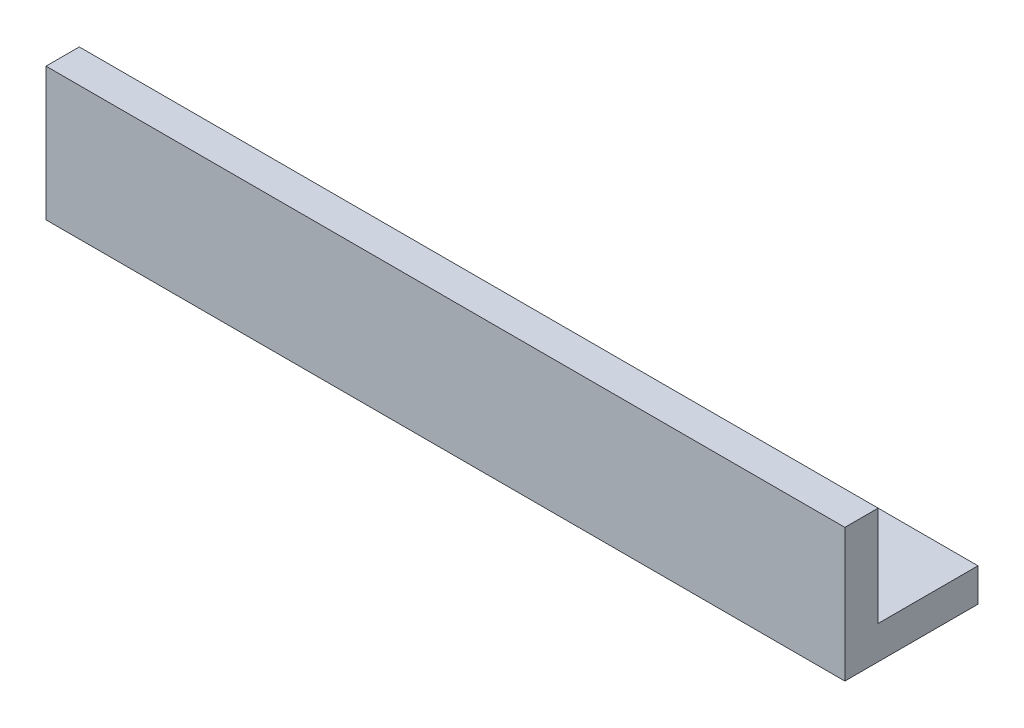
ISO-10303-21;
HEADER;
FILE_DESCRIPTION(('STEP AP214'),'2;1');
FILE_NAME('part.step','',(''),(''),'','','');
FILE_SCHEMA(('AUTOMOTIVE_DESIGN { 1 0 10303 214 1 1 1 1 }'));
ENDSEC;
DATA;
#1=APPLICATION_CONTEXT('core data for automotive mechanical design processes');
#2=APPLICATION_PROTOCOL_DEFINITION('international standard','automotive_design',2000,#1);
#3=PRODUCT_CONTEXT('',#1,'mechanical');
#4=PRODUCT('Part','Part','',(#3));
#5=PRODUCT_RELATED_PRODUCT_CATEGORY('part','',(#4));
#6=PRODUCT_DEFINITION_FORMATION('','',#4);
#7=PRODUCT_DEFINITION_CONTEXT('part definition',#1,'design');
#8=PRODUCT_DEFINITION('design','',#6,#7);
#9=PRODUCT_DEFINITION_SHAPE('','',#8);
#10=(LENGTH_UNIT() NAMED_UNIT(*) SI_UNIT(.MILLI.,.METRE.));
#11=(NAMED_UNIT(*) PLANE_ANGLE_UNIT() SI_UNIT($,.RADIAN.));
#12=(NAMED_UNIT(*) SI_UNIT($,.STERADIAN.) SOLID_ANGLE_UNIT());
#13=UNCERTAINTY_MEASURE_WITH_UNIT(LENGTH_MEASURE(1.E-05),#10,'distance_accuracy_value','');
#14=(GEOMETRIC_REPRESENTATION_CONTEXT(3) GLOBAL_UNCERTAINTY_ASSIGNED_CONTEXT((#13)) GLOBAL_UNIT_ASSIGNED_CONTEXT((#10,
#11,#12)) REPRESENTATION_CONTEXT('',''));
#15=CARTESIAN_POINT('',(0.,0.,0.));
#16=DIRECTION('',(0.,0.,1.));
#17=DIRECTION('',(1.,0.,0.));
#18=AXIS2_PLACEMENT_3D('',#15,#16,#17);
#19=CARTESIAN_POINT('',(-4.4135273568716,28.7042734044365,3.175));
#20=DIRECTION('',(1.,0.,0.));
#21=DIRECTION('',(0.,0.,-1.));
#22=AXIS2_PLACEMENT_3D('',#19,#20,#21);
#23=PLANE('',#22);
#24=DIRECTION('',(0.,-1.,0.));
#25=VECTOR('',#24,1.);
#26=CARTESIAN_POINT('',(-4.4135273568716,28.7042734044365,0.));
#27=LINE('',#26,#25);
#28=CARTESIAN_POINT('',(-4.4135273568716,28.7042734044365,0.));
#29=VERTEX_POINT('',#28);
#30=CARTESIAN_POINT('',(-4.4135273568716,19.1792734044365,0.));
#31=VERTEX_POINT('',#30);
#32=EDGE_CURVE('E134',#29,#31,#27,.T.);
#33=ORIENTED_EDGE('',*,*,#32,.T.);
#34=DIRECTION('',(0.,0.,-1.));
#35=VECTOR('',#34,1.);
#36=CARTESIAN_POINT('',(-4.4135273568716,19.1792734044365,-9.52499999999999));
#37=LINE('',#36,#35);
#38=CARTESIAN_POINT('',(-4.4135273568716,19.1792734044365,-9.52499999999999));
#39=VERTEX_POINT('',#38);
#40=EDGE_CURVE('E57',#31,#39,#37,.T.);
#41=ORIENTED_EDGE('',*,*,#40,.T.);
#42=DIRECTION('',(0.,-1.,0.));
#43=VECTOR('',#42,1.);
#44=CARTESIAN_POINT('',(-4.4135273568716,19.1792734044365,-9.52499999999999));
#45=LINE('',#44,#43);
#46=CARTESIAN_POINT('',(-4.4135273568716,16.0042734044365,-9.52499999999999));
#47=VERTEX_POINT('',#46);
#48=EDGE_CURVE('E115',#39,#47,#45,.T.);
#49=ORIENTED_EDGE('',*,*,#48,.T.);
#50=DIRECTION('',(0.,0.,-1.));
#51=VECTOR('',#50,1.);
#52=CARTESIAN_POINT('',(-4.4135273568716,16.0042734044365,3.175));
#53=LINE('',#52,#51);
#54=CARTESIAN_POINT('',(-4.4135273568716,16.0042734044365,3.175));
#55=VERTEX_POINT('',#54);
#56=EDGE_CURVE('E11',#55,#47,#53,.T.);
#57=ORIENTED_EDGE('',*,*,#56,.F.);
#58=DIRECTION('',(0.,-1.,0.));
#59=VECTOR('',#58,1.);
#60=CARTESIAN_POINT('',(-4.4135273568716,28.7042734044365,3.175));
#61=LINE('',#60,#59);
#62=CARTESIAN_POINT('',(-4.4135273568716,28.7042734044365,3.175));
#63=VERTEX_POINT('',#62);
#64=EDGE_CURVE('E146',#63,#55,#61,.T.);
#65=ORIENTED_EDGE('',*,*,#64,.F.);
#66=DIRECTION('',(0.,0.,-1.));
#67=VECTOR('',#66,1.);
#68=CARTESIAN_POINT('',(-4.4135273568716,28.7042734044365,3.175));
#69=LINE('',#68,#67);
#70=EDGE_CURVE('E156',#63,#29,#69,.T.);
#71=ORIENTED_EDGE('',*,*,#70,.T.);
#72=EDGE_LOOP('',(#33,#41,#49,#57,#65,#71));
#73=FACE_BOUND('',#72,.T.);
#74=ADVANCED_FACE('F39',(#73),#23,.F.);
#75=CARTESIAN_POINT('',(-4.4135273568716,16.0042734044365,3.175));
#76=DIRECTION('',(0.,1.,0.));
#77=DIRECTION('',(-1.,0.,0.));
#78=AXIS2_PLACEMENT_3D('',#75,#76,#77);
#79=PLANE('',#78);
#80=ORIENTED_EDGE('',*,*,#56,.T.);
#81=DIRECTION('',(1.,0.,0.));
#82=VECTOR('',#81,1.);
#83=CARTESIAN_POINT('',(-4.4135273568716,16.0042734044365,-9.52499999999999));
#84=LINE('',#83,#82);
#85=CARTESIAN_POINT('',(71.7864726431284,16.0042734044365,-9.52499999999998));
#86=VERTEX_POINT('',#85);
#87=EDGE_CURVE('E120',#47,#86,#84,.T.);
#88=ORIENTED_EDGE('',*,*,#87,.T.);
#89=DIRECTION('',(0.,0.,-1.));
#90=VECTOR('',#89,1.);
#91=CARTESIAN_POINT('',(71.7864726431284,16.0042734044365,3.175));
#92=LINE('',#91,#90);
#93=CARTESIAN_POINT('',(71.7864726431284,16.0042734044365,3.175));
#94=VERTEX_POINT('',#93);
#95=EDGE_CURVE('E47',#94,#86,#92,.T.);
#96=ORIENTED_EDGE('',*,*,#95,.F.);
#97=DIRECTION('',(1.,0.,0.));
#98=VECTOR('',#97,1.);
#99=CARTESIAN_POINT('',(-4.4135273568716,16.0042734044365,3.175));
#100=LINE('',#99,#98);
#101=EDGE_CURVE('E94',#55,#94,#100,.T.);
#102=ORIENTED_EDGE('',*,*,#101,.F.);
#103=EDGE_LOOP('',(#80,#88,#96,#102));
#104=FACE_BOUND('',#103,.T.);
#105=ADVANCED_FACE('F173',(#104),#79,.F.);
#106=CARTESIAN_POINT('',(71.7864726431284,28.7042734044365,3.175));
#107=DIRECTION('',(-1.,0.,0.));
#108=DIRECTION('',(0.,0.,1.));
#109=AXIS2_PLACEMENT_3D('',#106,#107,#108);
#110=PLANE('',#109);
#111=ORIENTED_EDGE('',*,*,#95,.T.);
#112=DIRECTION('',(0.,-1.,0.));
#113=VECTOR('',#112,1.);
#114=CARTESIAN_POINT('',(71.7864726431284,19.1792734044365,-9.52499999999998));
#115=LINE('',#114,#113);
#116=CARTESIAN_POINT('',(71.7864726431284,19.1792734044365,-9.52499999999998));
#117=VERTEX_POINT('',#116);
#118=EDGE_CURVE('E124',#117,#86,#115,.T.);
#119=ORIENTED_EDGE('',*,*,#118,.F.);
#120=DIRECTION('',(0.,0.,1.));
#121=VECTOR('',#120,1.);
#122=CARTESIAN_POINT('',(71.7864726431284,19.1792734044365,-9.52499999999998));
#123=LINE('',#122,#121);
#124=CARTESIAN_POINT('',(71.7864726431284,19.1792734044365,0.));
#125=VERTEX_POINT('',#124);
#126=EDGE_CURVE('E129',#117,#125,#123,.T.);
#127=ORIENTED_EDGE('',*,*,#126,.T.);
#128=DIRECTION('',(0.,1.,0.));
#129=VECTOR('',#128,1.);
#130=CARTESIAN_POINT('',(71.7864726431284,28.7042734044365,0.));
#131=LINE('',#130,#129);
#132=CARTESIAN_POINT('',(71.7864726431284,28.7042734044365,0.));
#133=VERTEX_POINT('',#132);
#134=EDGE_CURVE('E159',#125,#133,#131,.T.);
#135=ORIENTED_EDGE('',*,*,#134,.T.);
#136=DIRECTION('',(0.,0.,-1.));
#137=VECTOR('',#136,1.);
#138=CARTESIAN_POINT('',(71.7864726431284,28.7042734044365,3.175));
#139=LINE('',#138,#137);
#140=CARTESIAN_POINT('',(71.7864726431284,28.7042734044365,3.175));
#141=VERTEX_POINT('',#140);
#142=EDGE_CURVE('E166',#141,#133,#139,.T.);
#143=ORIENTED_EDGE('',*,*,#142,.F.);
#144=DIRECTION('',(0.,1.,0.));
#145=VECTOR('',#144,1.);
#146=CARTESIAN_POINT('',(71.7864726431284,28.7042734044365,3.175));
#147=LINE('',#146,#145);
#148=EDGE_CURVE('E151',#94,#141,#147,.T.);
#149=ORIENTED_EDGE('',*,*,#148,.F.);
#150=EDGE_LOOP('',(#111,#119,#127,#135,#143,#149));
#151=FACE_BOUND('',#150,.T.);
#152=ADVANCED_FACE('F171',(#151),#110,.F.);
#153=CARTESIAN_POINT('',(-4.4135273568716,28.7042734044365,3.175));
#154=DIRECTION('',(0.,-1.,0.));
#155=DIRECTION('',(0.,0.,-1.));
#156=AXIS2_PLACEMENT_3D('',#153,#154,#155);
#157=PLANE('',#156);
#158=DIRECTION('',(-1.,0.,0.));
#159=VECTOR('',#158,1.);
#160=CARTESIAN_POINT('',(-4.4135273568716,28.7042734044365,0.));
#161=LINE('',#160,#159);
#162=EDGE_CURVE('E87',#133,#29,#161,.T.);
#163=ORIENTED_EDGE('',*,*,#162,.T.);
#164=ORIENTED_EDGE('',*,*,#70,.F.);
#165=DIRECTION('',(-1.,0.,0.));
#166=VECTOR('',#165,1.);
#167=CARTESIAN_POINT('',(-4.4135273568716,28.7042734044365,3.175));
#168=LINE('',#167,#166);
#169=EDGE_CURVE('E69',#141,#63,#168,.T.);
#170=ORIENTED_EDGE('',*,*,#169,.F.);
#171=ORIENTED_EDGE('',*,*,#142,.T.);
#172=EDGE_LOOP('',(#163,#164,#170,#171));
#173=FACE_BOUND('',#172,.T.);
#174=ADVANCED_FACE('F177',(#173),#157,.F.);
#175=CARTESIAN_POINT('',(0.,0.,3.175));
#176=DIRECTION('',(0.,0.,1.));
#177=DIRECTION('',(1.,0.,0.));
#178=AXIS2_PLACEMENT_3D('',#175,#176,#177);
#179=PLANE('',#178);
#180=ORIENTED_EDGE('',*,*,#64,.T.);
#181=ORIENTED_EDGE('',*,*,#101,.T.);
#182=ORIENTED_EDGE('',*,*,#148,.T.);
#183=ORIENTED_EDGE('',*,*,#169,.T.);
#184=EDGE_LOOP('',(#180,#181,#182,#183));
#185=FACE_BOUND('',#184,.T.);
#186=ADVANCED_FACE('F175',(#185),#179,.T.);
#187=CARTESIAN_POINT('',(0.,0.,0.));
#188=DIRECTION('',(0.,0.,1.));
#189=DIRECTION('',(1.,0.,0.));
#190=AXIS2_PLACEMENT_3D('',#187,#188,#189);
#191=PLANE('',#190);
#192=ORIENTED_EDGE('',*,*,#134,.F.);
#193=DIRECTION('',(-1.,0.,0.));
#194=VECTOR('',#193,1.);
#195=CARTESIAN_POINT('',(-4.4135273568716,19.1792734044365,0.));
#196=LINE('',#195,#194);
#197=EDGE_CURVE('E125',#125,#31,#196,.T.);
#198=ORIENTED_EDGE('',*,*,#197,.T.);
#199=ORIENTED_EDGE('',*,*,#32,.F.);
#200=ORIENTED_EDGE('',*,*,#162,.F.);
#201=EDGE_LOOP('',(#192,#198,#199,#200));
#202=FACE_BOUND('',#201,.T.);
#203=ADVANCED_FACE('F184',(#202),#191,.F.);
#204=CARTESIAN_POINT('',(-4.4135273568716,19.1792734044365,-9.52499999999999));
#205=DIRECTION('',(0.,0.,-1.));
#206=DIRECTION('',(-1.,0.,0.));
#207=AXIS2_PLACEMENT_3D('',#204,#205,#206);
#208=PLANE('',#207);
#209=ORIENTED_EDGE('',*,*,#87,.F.);
#210=ORIENTED_EDGE('',*,*,#48,.F.);
#211=DIRECTION('',(1.,0.,0.));
#212=VECTOR('',#211,1.);
#213=CARTESIAN_POINT('',(-4.4135273568716,19.1792734044365,-9.52499999999999));
#214=LINE('',#213,#212);
#215=EDGE_CURVE('E118',#39,#117,#214,.T.);
#216=ORIENTED_EDGE('',*,*,#215,.T.);
#217=ORIENTED_EDGE('',*,*,#118,.T.);
#218=EDGE_LOOP('',(#209,#210,#216,#217));
#219=FACE_BOUND('',#218,.T.);
#220=ADVANCED_FACE('F116',(#219),#208,.T.);
#221=CARTESIAN_POINT('',(0.,19.1792734044365,0.));
#222=DIRECTION('',(0.,1.,0.));
#223=DIRECTION('',(0.,0.,1.));
#224=AXIS2_PLACEMENT_3D('',#221,#222,#223);
#225=PLANE('',#224);
#226=ORIENTED_EDGE('',*,*,#40,.F.);
#227=ORIENTED_EDGE('',*,*,#197,.F.);
#228=ORIENTED_EDGE('',*,*,#126,.F.);
#229=ORIENTED_EDGE('',*,*,#215,.F.);
#230=EDGE_LOOP('',(#226,#227,#228,#229));
#231=FACE_BOUND('',#230,.T.);
#232=ADVANCED_FACE('F128',(#231),#225,.T.);
#233=CLOSED_SHELL('',(#74,#105,#152,#174,#186,#203,#220,#232));
#234=MANIFOLD_SOLID_BREP('B2',#233);
#235=ADVANCED_BREP_SHAPE_REPRESENTATION('',(#18,#234),#14);
#236=SHAPE_DEFINITION_REPRESENTATION(#9,#235);
ENDSEC;
END-ISO-10303-21;
